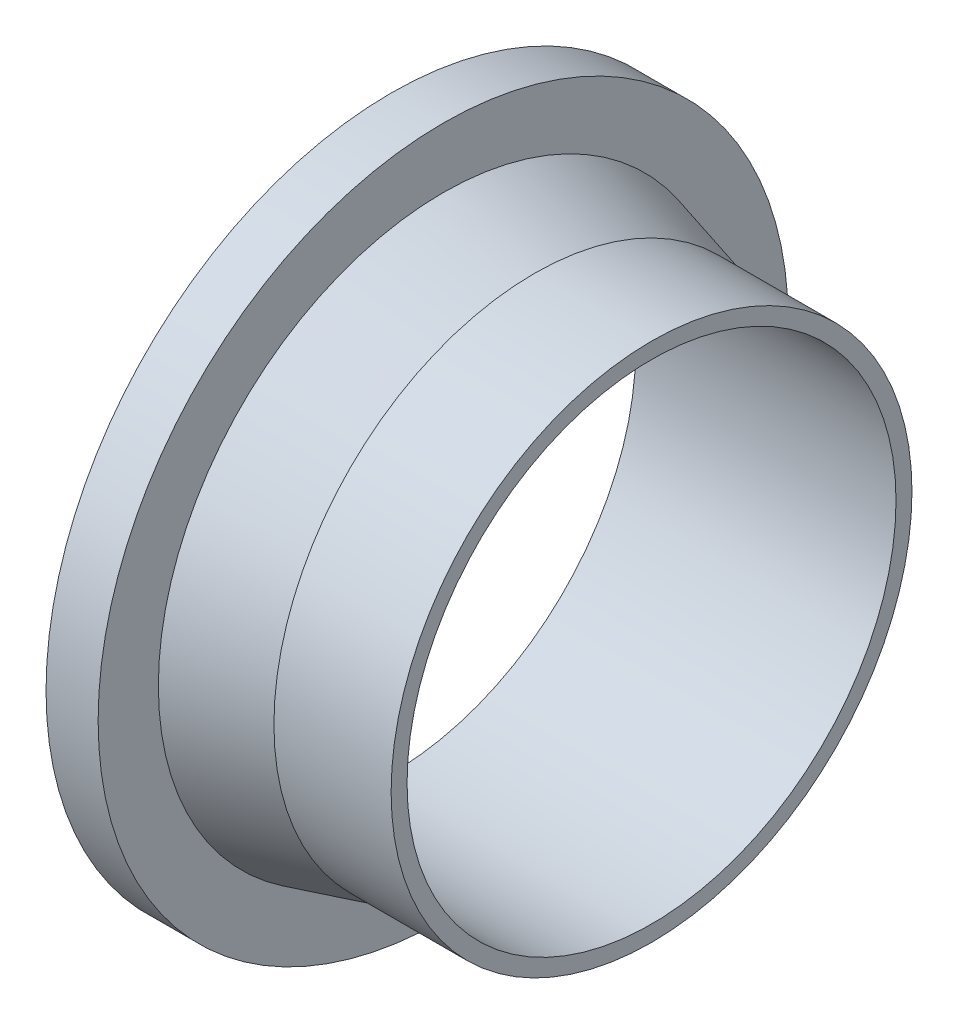
ISO-10303-21;
HEADER;
FILE_DESCRIPTION(('STEP AP214'),'2;1');
FILE_NAME('part.step','',(''),(''),'','','');
FILE_SCHEMA(('AUTOMOTIVE_DESIGN { 1 0 10303 214 1 1 1 1 }'));
ENDSEC;
DATA;
#1=APPLICATION_CONTEXT('core data for automotive mechanical design processes');
#2=APPLICATION_PROTOCOL_DEFINITION('international standard','automotive_design',2000,#1);
#3=PRODUCT_CONTEXT('',#1,'mechanical');
#4=PRODUCT('Part','Part','',(#3));
#5=PRODUCT_RELATED_PRODUCT_CATEGORY('part','',(#4));
#6=PRODUCT_DEFINITION_FORMATION('','',#4);
#7=PRODUCT_DEFINITION_CONTEXT('part definition',#1,'design');
#8=PRODUCT_DEFINITION('design','',#6,#7);
#9=PRODUCT_DEFINITION_SHAPE('','',#8);
#10=(LENGTH_UNIT() NAMED_UNIT(*) SI_UNIT(.MILLI.,.METRE.));
#11=(NAMED_UNIT(*) PLANE_ANGLE_UNIT() SI_UNIT($,.RADIAN.));
#12=(NAMED_UNIT(*) SI_UNIT($,.STERADIAN.) SOLID_ANGLE_UNIT());
#13=UNCERTAINTY_MEASURE_WITH_UNIT(LENGTH_MEASURE(1.E-05),#10,'distance_accuracy_value','');
#14=(GEOMETRIC_REPRESENTATION_CONTEXT(3) GLOBAL_UNCERTAINTY_ASSIGNED_CONTEXT((#13)) GLOBAL_UNIT_ASSIGNED_CONTEXT((#10,
#11,#12)) REPRESENTATION_CONTEXT('',''));
#15=CARTESIAN_POINT('',(0.,0.,0.));
#16=DIRECTION('',(0.,0.,1.));
#17=DIRECTION('',(1.,0.,0.));
#18=AXIS2_PLACEMENT_3D('',#15,#16,#17);
#19=CARTESIAN_POINT('',(-36.,0.,0.));
#20=DIRECTION('',(-1.,0.,0.));
#21=DIRECTION('',(0.,0.,1.));
#22=AXIS2_PLACEMENT_3D('',#19,#20,#21);
#23=CONICAL_SURFACE('',#22,80.,0.261713502401205);
#24=CARTESIAN_POINT('',(-64.,0.,0.));
#25=DIRECTION('',(-1.,0.,0.));
#26=DIRECTION('',(0.,0.,1.));
#27=AXIS2_PLACEMENT_3D('',#24,#25,#26);
#28=CIRCLE('',#27,87.5);
#29=CARTESIAN_POINT('',(-64.,0.,87.5));
#30=VERTEX_POINT('',#29);
#31=EDGE_CURVE('E16',#30,#30,#28,.T.);
#32=ORIENTED_EDGE('',*,*,#31,.F.);
#33=EDGE_LOOP('',(#32));
#34=FACE_BOUND('',#33,.T.);
#35=CARTESIAN_POINT('',(-36.,0.,0.));
#36=DIRECTION('',(-1.,0.,0.));
#37=DIRECTION('',(0.,1.,0.));
#38=AXIS2_PLACEMENT_3D('',#35,#36,#37);
#39=CIRCLE('',#38,80.);
#40=CARTESIAN_POINT('',(-36.,80.,0.));
#41=VERTEX_POINT('',#40);
#42=EDGE_CURVE('E28',#41,#41,#39,.F.);
#43=ORIENTED_EDGE('',*,*,#42,.F.);
#44=EDGE_LOOP('',(#43));
#45=FACE_BOUND('',#44,.T.);
#46=ADVANCED_FACE('F13',(#34,#45),#23,.T.);
#47=CARTESIAN_POINT('',(-64.,106.,107.272004216363));
#48=DIRECTION('',(1.,0.,0.));
#49=DIRECTION('',(0.,-1.,0.));
#50=AXIS2_PLACEMENT_3D('',#47,#48,#49);
#51=PLANE('',#50);
#52=ORIENTED_EDGE('',*,*,#31,.T.);
#53=EDGE_LOOP('',(#52));
#54=FACE_BOUND('',#53,.T.);
#55=CARTESIAN_POINT('',(-64.,0.,0.));
#56=DIRECTION('',(-1.,0.,0.));
#57=DIRECTION('',(0.,0.,1.));
#58=AXIS2_PLACEMENT_3D('',#55,#56,#57);
#59=CIRCLE('',#58,106.);
#60=CARTESIAN_POINT('',(-64.,0.,106.));
#61=VERTEX_POINT('',#60);
#62=EDGE_CURVE('E34',#61,#61,#59,.T.);
#63=ORIENTED_EDGE('',*,*,#62,.F.);
#64=EDGE_LOOP('',(#63));
#65=FACE_BOUND('',#64,.T.);
#66=ADVANCED_FACE('F44',(#54,#65),#51,.T.);
#67=CARTESIAN_POINT('',(-36.,0.,0.));
#68=DIRECTION('',(-1.,0.,0.));
#69=DIRECTION('',(0.,0.,1.));
#70=AXIS2_PLACEMENT_3D('',#67,#68,#69);
#71=CYLINDRICAL_SURFACE('',#70,80.);
#72=ORIENTED_EDGE('',*,*,#42,.T.);
#73=EDGE_LOOP('',(#72));
#74=FACE_BOUND('',#73,.T.);
#75=CARTESIAN_POINT('',(0.,0.,0.));
#76=DIRECTION('',(-1.,0.,0.));
#77=DIRECTION('',(0.,0.,1.));
#78=AXIS2_PLACEMENT_3D('',#75,#76,#77);
#79=CIRCLE('',#78,80.);
#80=CARTESIAN_POINT('',(0.,0.,80.));
#81=VERTEX_POINT('',#80);
#82=EDGE_CURVE('E32',#81,#81,#79,.F.);
#83=ORIENTED_EDGE('',*,*,#82,.F.);
#84=EDGE_LOOP('',(#83));
#85=FACE_BOUND('',#84,.T.);
#86=ADVANCED_FACE('F53',(#74,#85),#71,.T.);
#87=CARTESIAN_POINT('',(-80.,0.,0.));
#88=DIRECTION('',(-1.,0.,0.));
#89=DIRECTION('',(0.,0.,1.));
#90=AXIS2_PLACEMENT_3D('',#87,#88,#89);
#91=CYLINDRICAL_SURFACE('',#90,106.);
#92=CARTESIAN_POINT('',(-80.,0.,0.));
#93=DIRECTION('',(-1.,0.,0.));
#94=DIRECTION('',(0.,0.,1.));
#95=AXIS2_PLACEMENT_3D('',#92,#93,#94);
#96=CIRCLE('',#95,106.);
#97=CARTESIAN_POINT('',(-80.,0.,106.));
#98=VERTEX_POINT('',#97);
#99=EDGE_CURVE('E25',#98,#98,#96,.T.);
#100=ORIENTED_EDGE('',*,*,#99,.F.);
#101=EDGE_LOOP('',(#100));
#102=FACE_BOUND('',#101,.T.);
#103=ORIENTED_EDGE('',*,*,#62,.T.);
#104=EDGE_LOOP('',(#103));
#105=FACE_BOUND('',#104,.T.);
#106=ADVANCED_FACE('F68',(#102,#105),#91,.T.);
#107=CARTESIAN_POINT('',(0.,80.,80.9600031625414));
#108=DIRECTION('',(1.,0.,0.));
#109=DIRECTION('',(0.,-1.,0.));
#110=AXIS2_PLACEMENT_3D('',#107,#108,#109);
#111=PLANE('',#110);
#112=CARTESIAN_POINT('',(0.,0.,0.));
#113=DIRECTION('',(-1.,0.,0.));
#114=DIRECTION('',(0.,0.,1.));
#115=AXIS2_PLACEMENT_3D('',#112,#113,#114);
#116=CIRCLE('',#115,75.1);
#117=CARTESIAN_POINT('',(0.,0.,75.1));
#118=VERTEX_POINT('',#117);
#119=EDGE_CURVE('E20',#118,#118,#116,.F.);
#120=ORIENTED_EDGE('',*,*,#119,.F.);
#121=EDGE_LOOP('',(#120));
#122=FACE_BOUND('',#121,.T.);
#123=ORIENTED_EDGE('',*,*,#82,.T.);
#124=EDGE_LOOP('',(#123));
#125=FACE_BOUND('',#124,.T.);
#126=ADVANCED_FACE('F62',(#122,#125),#111,.T.);
#127=CARTESIAN_POINT('',(-80.,-106.,107.272004216708));
#128=DIRECTION('',(-1.,0.,0.));
#129=DIRECTION('',(0.,1.,0.));
#130=AXIS2_PLACEMENT_3D('',#127,#128,#129);
#131=PLANE('',#130);
#132=CARTESIAN_POINT('',(-80.,0.,0.));
#133=DIRECTION('',(-1.,0.,0.));
#134=DIRECTION('',(0.,0.,1.));
#135=AXIS2_PLACEMENT_3D('',#132,#133,#134);
#136=CIRCLE('',#135,75.1);
#137=CARTESIAN_POINT('',(-80.,0.,75.1));
#138=VERTEX_POINT('',#137);
#139=EDGE_CURVE('E8',#138,#138,#136,.T.);
#140=ORIENTED_EDGE('',*,*,#139,.F.);
#141=EDGE_LOOP('',(#140));
#142=FACE_BOUND('',#141,.T.);
#143=ORIENTED_EDGE('',*,*,#99,.T.);
#144=EDGE_LOOP('',(#143));
#145=FACE_BOUND('',#144,.T.);
#146=ADVANCED_FACE('F56',(#142,#145),#131,.T.);
#147=CARTESIAN_POINT('',(0.,0.,0.));
#148=DIRECTION('',(-1.,0.,0.));
#149=DIRECTION('',(0.,0.,1.));
#150=AXIS2_PLACEMENT_3D('',#147,#148,#149);
#151=CYLINDRICAL_SURFACE('',#150,75.1);
#152=ORIENTED_EDGE('',*,*,#119,.T.);
#153=EDGE_LOOP('',(#152));
#154=FACE_BOUND('',#153,.T.);
#155=ORIENTED_EDGE('',*,*,#139,.T.);
#156=EDGE_LOOP('',(#155));
#157=FACE_BOUND('',#156,.T.);
#158=ADVANCED_FACE('F54',(#154,#157),#151,.F.);
#159=CLOSED_SHELL('',(#46,#66,#86,#106,#126,#146,#158));
#160=MANIFOLD_SOLID_BREP('B1',#159);
#161=ADVANCED_BREP_SHAPE_REPRESENTATION('',(#18,#160),#14);
#162=SHAPE_DEFINITION_REPRESENTATION(#9,#161);
ENDSEC;
END-ISO-10303-21;
